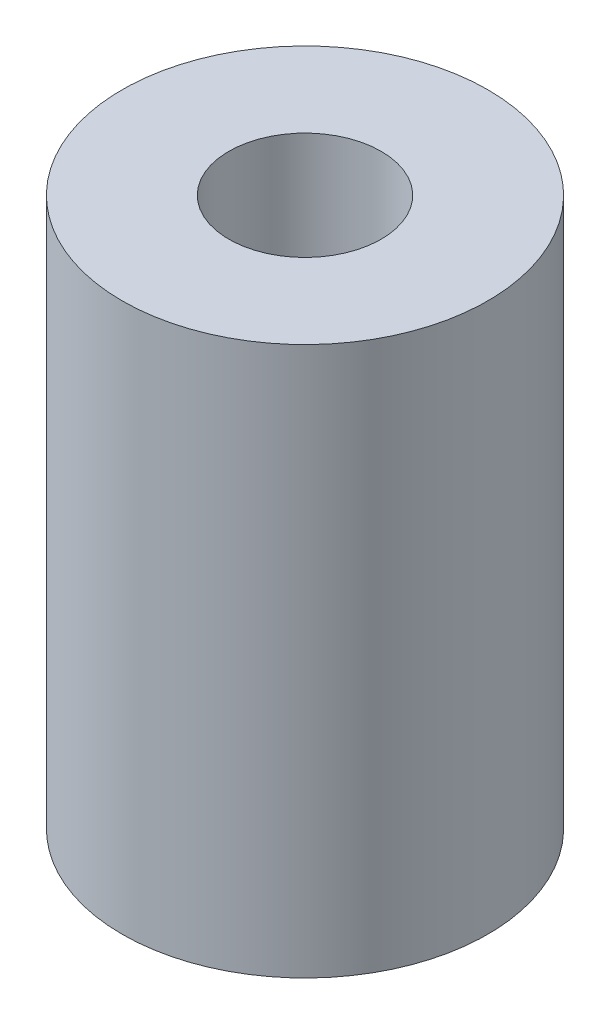
ISO-10303-21;
HEADER;
FILE_DESCRIPTION(('STEP AP214'),'2;1');
FILE_NAME('part.step','',(''),(''),'','','');
FILE_SCHEMA(('AUTOMOTIVE_DESIGN { 1 0 10303 214 1 1 1 1 }'));
ENDSEC;
DATA;
#1=APPLICATION_CONTEXT('core data for automotive mechanical design processes');
#2=APPLICATION_PROTOCOL_DEFINITION('international standard','automotive_design',2000,#1);
#3=PRODUCT_CONTEXT('',#1,'mechanical');
#4=PRODUCT('Part','Part','',(#3));
#5=PRODUCT_RELATED_PRODUCT_CATEGORY('part','',(#4));
#6=PRODUCT_DEFINITION_FORMATION('','',#4);
#7=PRODUCT_DEFINITION_CONTEXT('part definition',#1,'design');
#8=PRODUCT_DEFINITION('design','',#6,#7);
#9=PRODUCT_DEFINITION_SHAPE('','',#8);
#10=(LENGTH_UNIT() NAMED_UNIT(*) SI_UNIT(.MILLI.,.METRE.));
#11=(NAMED_UNIT(*) PLANE_ANGLE_UNIT() SI_UNIT($,.RADIAN.));
#12=(NAMED_UNIT(*) SI_UNIT($,.STERADIAN.) SOLID_ANGLE_UNIT());
#13=UNCERTAINTY_MEASURE_WITH_UNIT(LENGTH_MEASURE(1.E-05),#10,'distance_accuracy_value','');
#14=(GEOMETRIC_REPRESENTATION_CONTEXT(3) GLOBAL_UNCERTAINTY_ASSIGNED_CONTEXT((#13)) GLOBAL_UNIT_ASSIGNED_CONTEXT((#10,
#11,#12)) REPRESENTATION_CONTEXT('',''));
#15=CARTESIAN_POINT('',(0.,0.,0.));
#16=DIRECTION('',(0.,0.,1.));
#17=DIRECTION('',(1.,0.,0.));
#18=AXIS2_PLACEMENT_3D('',#15,#16,#17);
#19=CARTESIAN_POINT('',(6.,0.,0.));
#20=DIRECTION('',(0.,-1.,0.));
#21=DIRECTION('',(0.,0.,-1.));
#22=AXIS2_PLACEMENT_3D('',#19,#20,#21);
#23=PLANE('',#22);
#24=CARTESIAN_POINT('',(0.,0.,0.));
#25=DIRECTION('',(0.,-1.,0.));
#26=DIRECTION('',(0.,0.,-1.));
#27=AXIS2_PLACEMENT_3D('',#24,#25,#26);
#28=CIRCLE('',#27,6.);
#29=CARTESIAN_POINT('',(0.,0.,-6.));
#30=VERTEX_POINT('',#29);
#31=EDGE_CURVE('E54',#30,#30,#28,.T.);
#32=ORIENTED_EDGE('',*,*,#31,.T.);
#33=EDGE_LOOP('',(#32));
#34=FACE_BOUND('',#33,.T.);
#35=CARTESIAN_POINT('',(0.,0.,0.));
#36=DIRECTION('',(0.,-1.,0.));
#37=DIRECTION('',(0.,0.,-1.));
#38=AXIS2_PLACEMENT_3D('',#35,#36,#37);
#39=CIRCLE('',#38,2.5);
#40=CARTESIAN_POINT('',(0.,0.,-2.5));
#41=VERTEX_POINT('',#40);
#42=EDGE_CURVE('E10',#41,#41,#39,.T.);
#43=ORIENTED_EDGE('',*,*,#42,.F.);
#44=EDGE_LOOP('',(#43));
#45=FACE_BOUND('',#44,.T.);
#46=ADVANCED_FACE('F37',(#34,#45),#23,.T.);
#47=CARTESIAN_POINT('',(0.,0.,0.));
#48=DIRECTION('',(0.,-1.,0.));
#49=DIRECTION('',(0.,0.,-1.));
#50=AXIS2_PLACEMENT_3D('',#47,#48,#49);
#51=CYLINDRICAL_SURFACE('',#50,2.5);
#52=ORIENTED_EDGE('',*,*,#42,.T.);
#53=EDGE_LOOP('',(#52));
#54=FACE_BOUND('',#53,.T.);
#55=CARTESIAN_POINT('',(0.,18.,0.));
#56=DIRECTION('',(0.,-1.,0.));
#57=DIRECTION('',(0.,0.,-1.));
#58=AXIS2_PLACEMENT_3D('',#55,#56,#57);
#59=CIRCLE('',#58,2.5);
#60=CARTESIAN_POINT('',(0.,18.,-2.5));
#61=VERTEX_POINT('',#60);
#62=EDGE_CURVE('E44',#61,#61,#59,.T.);
#63=ORIENTED_EDGE('',*,*,#62,.F.);
#64=EDGE_LOOP('',(#63));
#65=FACE_BOUND('',#64,.T.);
#66=ADVANCED_FACE('F71',(#54,#65),#51,.F.);
#67=CARTESIAN_POINT('',(2.5,18.,0.));
#68=DIRECTION('',(0.,1.,0.));
#69=DIRECTION('',(0.,0.,1.));
#70=AXIS2_PLACEMENT_3D('',#67,#68,#69);
#71=PLANE('',#70);
#72=ORIENTED_EDGE('',*,*,#62,.T.);
#73=EDGE_LOOP('',(#72));
#74=FACE_BOUND('',#73,.T.);
#75=CARTESIAN_POINT('',(0.,18.,0.));
#76=DIRECTION('',(0.,-1.,0.));
#77=DIRECTION('',(0.,0.,-1.));
#78=AXIS2_PLACEMENT_3D('',#75,#76,#77);
#79=CIRCLE('',#78,6.);
#80=CARTESIAN_POINT('',(0.,18.,-6.));
#81=VERTEX_POINT('',#80);
#82=EDGE_CURVE('E49',#81,#81,#79,.T.);
#83=ORIENTED_EDGE('',*,*,#82,.F.);
#84=EDGE_LOOP('',(#83));
#85=FACE_BOUND('',#84,.T.);
#86=ADVANCED_FACE('F65',(#74,#85),#71,.T.);
#87=CARTESIAN_POINT('',(0.,0.,0.));
#88=DIRECTION('',(0.,-1.,0.));
#89=DIRECTION('',(0.,0.,-1.));
#90=AXIS2_PLACEMENT_3D('',#87,#88,#89);
#91=CYLINDRICAL_SURFACE('',#90,6.);
#92=ORIENTED_EDGE('',*,*,#82,.T.);
#93=EDGE_LOOP('',(#92));
#94=FACE_BOUND('',#93,.T.);
#95=ORIENTED_EDGE('',*,*,#31,.F.);
#96=EDGE_LOOP('',(#95));
#97=FACE_BOUND('',#96,.T.);
#98=ADVANCED_FACE('F63',(#94,#97),#91,.T.);
#99=CLOSED_SHELL('',(#46,#66,#86,#98));
#100=MANIFOLD_SOLID_BREP('B2',#99);
#101=ADVANCED_BREP_SHAPE_REPRESENTATION('',(#18,#100),#14);
#102=SHAPE_DEFINITION_REPRESENTATION(#9,#101);
ENDSEC;
END-ISO-10303-21;
